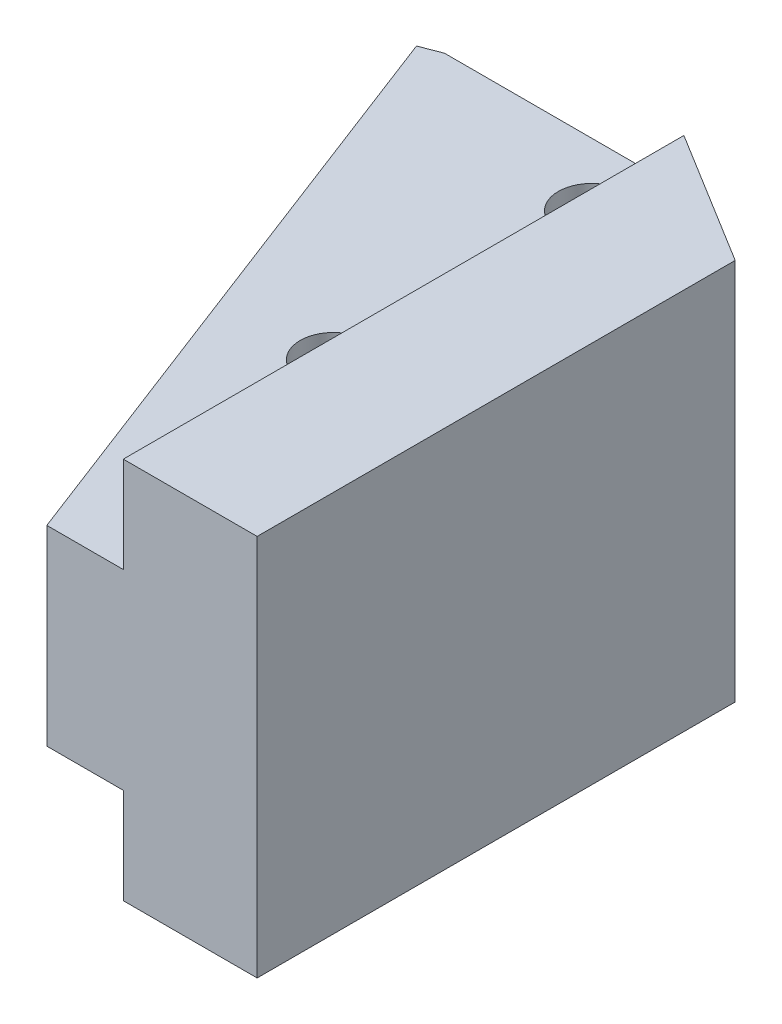
ISO-10303-21;
HEADER;
FILE_DESCRIPTION(('STEP AP214'),'2;1');
FILE_NAME('part.step','',(''),(''),'','','');
FILE_SCHEMA(('AUTOMOTIVE_DESIGN { 1 0 10303 214 1 1 1 1 }'));
ENDSEC;
DATA;
#1=APPLICATION_CONTEXT('core data for automotive mechanical design processes');
#2=APPLICATION_PROTOCOL_DEFINITION('international standard','automotive_design',2000,#1);
#3=PRODUCT_CONTEXT('',#1,'mechanical');
#4=PRODUCT('Part','Part','',(#3));
#5=PRODUCT_RELATED_PRODUCT_CATEGORY('part','',(#4));
#6=PRODUCT_DEFINITION_FORMATION('','',#4);
#7=PRODUCT_DEFINITION_CONTEXT('part definition',#1,'design');
#8=PRODUCT_DEFINITION('design','',#6,#7);
#9=PRODUCT_DEFINITION_SHAPE('','',#8);
#10=(LENGTH_UNIT() NAMED_UNIT(*) SI_UNIT(.MILLI.,.METRE.));
#11=(NAMED_UNIT(*) PLANE_ANGLE_UNIT() SI_UNIT($,.RADIAN.));
#12=(NAMED_UNIT(*) SI_UNIT($,.STERADIAN.) SOLID_ANGLE_UNIT());
#13=UNCERTAINTY_MEASURE_WITH_UNIT(LENGTH_MEASURE(1.E-05),#10,'distance_accuracy_value','');
#14=(GEOMETRIC_REPRESENTATION_CONTEXT(3) GLOBAL_UNCERTAINTY_ASSIGNED_CONTEXT((#13)) GLOBAL_UNIT_ASSIGNED_CONTEXT((#10,
#11,#12)) REPRESENTATION_CONTEXT('',''));
#15=CARTESIAN_POINT('',(0.,0.,0.));
#16=DIRECTION('',(0.,0.,1.));
#17=DIRECTION('',(1.,0.,0.));
#18=AXIS2_PLACEMENT_3D('',#15,#16,#17);
#19=CARTESIAN_POINT('',(4.,5.,40.));
#20=DIRECTION('',(0.,-1.,0.));
#21=DIRECTION('',(1.,0.,0.));
#22=AXIS2_PLACEMENT_3D('',#19,#20,#21);
#23=PLANE('',#22);
#24=CARTESIAN_POINT('',(0.,5.,25.));
#25=DIRECTION('',(0.,-1.,0.));
#26=DIRECTION('',(1.,0.,0.));
#27=AXIS2_PLACEMENT_3D('',#24,#25,#26);
#28=CIRCLE('',#27,1.75);
#29=CARTESIAN_POINT('',(1.75,5.,25.));
#30=VERTEX_POINT('',#29);
#31=EDGE_CURVE('E124',#30,#30,#28,.T.);
#32=ORIENTED_EDGE('',*,*,#31,.T.);
#33=EDGE_LOOP('',(#32));
#34=FACE_BOUND('',#33,.T.);
#35=CARTESIAN_POINT('',(-6.83481049534862E-13,5.,11.5));
#36=DIRECTION('',(0.,-1.,0.));
#37=DIRECTION('',(1.,0.,0.));
#38=AXIS2_PLACEMENT_3D('',#35,#36,#37);
#39=CIRCLE('',#38,1.75);
#40=CARTESIAN_POINT('',(1.74999999999932,5.,11.5));
#41=VERTEX_POINT('',#40);
#42=EDGE_CURVE('E154',#41,#41,#39,.T.);
#43=ORIENTED_EDGE('',*,*,#42,.T.);
#44=EDGE_LOOP('',(#43));
#45=FACE_BOUND('',#44,.T.);
#46=DIRECTION('',(0.,0.,-1.));
#47=VECTOR('',#46,1.);
#48=CARTESIAN_POINT('',(4.,5.,40.));
#49=LINE('',#48,#47);
#50=CARTESIAN_POINT('',(4.,5.,40.));
#51=VERTEX_POINT('',#50);
#52=CARTESIAN_POINT('',(4.,5.,10.6834420459416));
#53=VERTEX_POINT('',#52);
#54=EDGE_CURVE('E143',#51,#53,#49,.T.);
#55=ORIENTED_EDGE('',*,*,#54,.T.);
#56=DIRECTION('',(-0.851176775563715,0.,-0.524879125838471));
#57=VECTOR('',#56,1.);
#58=CARTESIAN_POINT('',(17.097609724484,5.,18.7600979652807));
#59=LINE('',#58,#57);
#60=CARTESIAN_POINT('',(7.32053306862213E-13,4.99999999999998,8.2168375007659));
#61=VERTEX_POINT('',#60);
#62=EDGE_CURVE('E171',#53,#61,#59,.T.);
#63=ORIENTED_EDGE('',*,*,#62,.T.);
#64=DIRECTION('',(-1.,0.,0.));
#65=VECTOR('',#64,1.);
#66=CARTESIAN_POINT('',(4.,5.,8.2168375007659));
#67=LINE('',#66,#65);
#68=CARTESIAN_POINT('',(-10.9852372608359,4.99999999999998,8.2168375007659));
#69=VERTEX_POINT('',#68);
#70=EDGE_CURVE('E168',#61,#69,#67,.T.);
#71=ORIENTED_EDGE('',*,*,#70,.T.);
#72=DIRECTION('',(-0.933580426497201,0.,0.358367949545302));
#73=VECTOR('',#72,1.);
#74=CARTESIAN_POINT('',(-12.0443509144595,5.,8.62339314140695));
#75=LINE('',#74,#73);
#76=CARTESIAN_POINT('',(-12.0443509144595,5.,8.62339314140695));
#77=VERTEX_POINT('',#76);
#78=EDGE_CURVE('E180',#69,#77,#75,.T.);
#79=ORIENTED_EDGE('',*,*,#78,.T.);
#80=DIRECTION('',(0.358367949545302,0.,0.933580426497201));
#81=VECTOR('',#80,1.);
#82=CARTESIAN_POINT('',(0.,5.,40.));
#83=LINE('',#82,#81);
#84=CARTESIAN_POINT('',(0.,5.,40.));
#85=VERTEX_POINT('',#84);
#86=EDGE_CURVE('E186',#77,#85,#83,.T.);
#87=ORIENTED_EDGE('',*,*,#86,.T.);
#88=DIRECTION('',(-1.,0.,0.));
#89=VECTOR('',#88,1.);
#90=CARTESIAN_POINT('',(4.,5.,40.));
#91=LINE('',#90,#89);
#92=EDGE_CURVE('E193',#51,#85,#91,.T.);
#93=ORIENTED_EDGE('',*,*,#92,.F.);
#94=EDGE_LOOP('',(#55,#63,#71,#79,#87,#93));
#95=FACE_BOUND('',#94,.T.);
#96=ADVANCED_FACE('F34',(#34,#45,#95),#23,.F.);
#97=CARTESIAN_POINT('',(0.,-5.,40.));
#98=DIRECTION('',(0.,1.,0.));
#99=DIRECTION('',(-1.,0.,0.));
#100=AXIS2_PLACEMENT_3D('',#97,#98,#99);
#101=PLANE('',#100);
#102=CARTESIAN_POINT('',(0.,-5.,25.));
#103=DIRECTION('',(0.,1.,0.));
#104=DIRECTION('',(-1.,0.,0.));
#105=AXIS2_PLACEMENT_3D('',#102,#103,#104);
#106=CIRCLE('',#105,1.75);
#107=CARTESIAN_POINT('',(-1.75,-5.,25.));
#108=VERTEX_POINT('',#107);
#109=EDGE_CURVE('E37',#108,#108,#106,.T.);
#110=ORIENTED_EDGE('',*,*,#109,.T.);
#111=EDGE_LOOP('',(#110));
#112=FACE_BOUND('',#111,.T.);
#113=CARTESIAN_POINT('',(-6.83481049534862E-13,-5.,11.5));
#114=DIRECTION('',(0.,1.,0.));
#115=DIRECTION('',(-1.,0.,0.));
#116=AXIS2_PLACEMENT_3D('',#113,#114,#115);
#117=CIRCLE('',#116,1.75);
#118=CARTESIAN_POINT('',(-1.75000000000069,-5.,11.5));
#119=VERTEX_POINT('',#118);
#120=EDGE_CURVE('E152',#119,#119,#117,.T.);
#121=ORIENTED_EDGE('',*,*,#120,.T.);
#122=EDGE_LOOP('',(#121));
#123=FACE_BOUND('',#122,.T.);
#124=DIRECTION('',(1.,0.,0.));
#125=VECTOR('',#124,1.);
#126=CARTESIAN_POINT('',(0.,-5.,8.2168375007659));
#127=LINE('',#126,#125);
#128=CARTESIAN_POINT('',(-10.9852372608359,-5.,8.2168375007659));
#129=VERTEX_POINT('',#128);
#130=CARTESIAN_POINT('',(7.32053306862213E-13,-5.00000000000001,8.2168375007659));
#131=VERTEX_POINT('',#130);
#132=EDGE_CURVE('E50',#129,#131,#127,.T.);
#133=ORIENTED_EDGE('',*,*,#132,.T.);
#134=DIRECTION('',(0.851176775563715,0.,0.524879125838471));
#135=VECTOR('',#134,1.);
#136=CARTESIAN_POINT('',(14.1996021114478,-5.,16.9730382777131));
#137=LINE('',#136,#135);
#138=CARTESIAN_POINT('',(4.,-5.,10.6834420459416));
#139=VERTEX_POINT('',#138);
#140=EDGE_CURVE('E177',#131,#139,#137,.T.);
#141=ORIENTED_EDGE('',*,*,#140,.T.);
#142=DIRECTION('',(0.,0.,-1.));
#143=VECTOR('',#142,1.);
#144=CARTESIAN_POINT('',(4.,-5.,40.));
#145=LINE('',#144,#143);
#146=CARTESIAN_POINT('',(4.,-5.,40.));
#147=VERTEX_POINT('',#146);
#148=EDGE_CURVE('E149',#147,#139,#145,.T.);
#149=ORIENTED_EDGE('',*,*,#148,.F.);
#150=DIRECTION('',(1.,0.,0.));
#151=VECTOR('',#150,1.);
#152=CARTESIAN_POINT('',(0.,-5.,40.));
#153=LINE('',#152,#151);
#154=CARTESIAN_POINT('',(0.,-5.,40.));
#155=VERTEX_POINT('',#154);
#156=EDGE_CURVE('E198',#155,#147,#153,.T.);
#157=ORIENTED_EDGE('',*,*,#156,.F.);
#158=DIRECTION('',(-0.358367949545302,0.,-0.933580426497201));
#159=VECTOR('',#158,1.);
#160=CARTESIAN_POINT('',(0.,-5.,40.));
#161=LINE('',#160,#159);
#162=CARTESIAN_POINT('',(-12.0443509144595,-5.,8.62339314140695));
#163=VERTEX_POINT('',#162);
#164=EDGE_CURVE('E181',#155,#163,#161,.T.);
#165=ORIENTED_EDGE('',*,*,#164,.T.);
#166=DIRECTION('',(0.933580426497201,0.,-0.358367949545302));
#167=VECTOR('',#166,1.);
#168=CARTESIAN_POINT('',(-12.0443509144595,-5.,8.62339314140695));
#169=LINE('',#168,#167);
#170=EDGE_CURVE('E183',#163,#129,#169,.T.);
#171=ORIENTED_EDGE('',*,*,#170,.T.);
#172=EDGE_LOOP('',(#133,#141,#149,#157,#165,#171));
#173=FACE_BOUND('',#172,.T.);
#174=ADVANCED_FACE('F223',(#112,#123,#173),#101,.F.);
#175=CARTESIAN_POINT('',(4.,-5.,40.));
#176=DIRECTION('',(1.,0.,0.));
#177=DIRECTION('',(0.,1.,0.));
#178=AXIS2_PLACEMENT_3D('',#175,#176,#177);
#179=PLANE('',#178);
#180=ORIENTED_EDGE('',*,*,#148,.T.);
#181=DIRECTION('',(0.,-1.,0.));
#182=VECTOR('',#181,1.);
#183=CARTESIAN_POINT('',(4.,-5.00000000000001,10.6834420459416));
#184=LINE('',#183,#182);
#185=CARTESIAN_POINT('',(4.,-10.,10.6834420459416));
#186=VERTEX_POINT('',#185);
#187=EDGE_CURVE('E174',#139,#186,#184,.T.);
#188=ORIENTED_EDGE('',*,*,#187,.T.);
#189=DIRECTION('',(0.,0.,-1.));
#190=VECTOR('',#189,1.);
#191=CARTESIAN_POINT('',(4.,-10.,40.));
#192=LINE('',#191,#190);
#193=CARTESIAN_POINT('',(4.,-10.,40.));
#194=VERTEX_POINT('',#193);
#195=EDGE_CURVE('E141',#194,#186,#192,.T.);
#196=ORIENTED_EDGE('',*,*,#195,.F.);
#197=DIRECTION('',(0.,-1.,0.));
#198=VECTOR('',#197,1.);
#199=CARTESIAN_POINT('',(4.,-5.,40.));
#200=LINE('',#199,#198);
#201=EDGE_CURVE('E200',#147,#194,#200,.T.);
#202=ORIENTED_EDGE('',*,*,#201,.F.);
#203=EDGE_LOOP('',(#180,#188,#196,#202));
#204=FACE_BOUND('',#203,.T.);
#205=ADVANCED_FACE('F228',(#204),#179,.F.);
#206=CARTESIAN_POINT('',(4.,-10.,40.));
#207=DIRECTION('',(0.,1.,0.));
#208=DIRECTION('',(0.,0.,1.));
#209=AXIS2_PLACEMENT_3D('',#206,#207,#208);
#210=PLANE('',#209);
#211=ORIENTED_EDGE('',*,*,#195,.T.);
#212=DIRECTION('',(-0.851176775563715,0.,-0.524879125838471));
#213=VECTOR('',#212,1.);
#214=CARTESIAN_POINT('',(7.32053306862213E-13,-10.,8.2168375007659));
#215=LINE('',#214,#213);
#216=CARTESIAN_POINT('',(11.,-10.,15.));
#217=VERTEX_POINT('',#216);
#218=EDGE_CURVE('E135',#217,#186,#215,.T.);
#219=ORIENTED_EDGE('',*,*,#218,.F.);
#220=DIRECTION('',(0.,0.,-1.));
#221=VECTOR('',#220,1.);
#222=CARTESIAN_POINT('',(11.,-10.,40.));
#223=LINE('',#222,#221);
#224=CARTESIAN_POINT('',(11.,-10.,40.));
#225=VERTEX_POINT('',#224);
#226=EDGE_CURVE('E134',#225,#217,#223,.T.);
#227=ORIENTED_EDGE('',*,*,#226,.F.);
#228=DIRECTION('',(1.,0.,0.));
#229=VECTOR('',#228,1.);
#230=CARTESIAN_POINT('',(4.,-10.,40.));
#231=LINE('',#230,#229);
#232=EDGE_CURVE('E202',#194,#225,#231,.T.);
#233=ORIENTED_EDGE('',*,*,#232,.F.);
#234=EDGE_LOOP('',(#211,#219,#227,#233));
#235=FACE_BOUND('',#234,.T.);
#236=ADVANCED_FACE('F269',(#235),#210,.F.);
#237=CARTESIAN_POINT('',(11.,-10.,40.));
#238=DIRECTION('',(-1.,0.,0.));
#239=DIRECTION('',(0.,0.,1.));
#240=AXIS2_PLACEMENT_3D('',#237,#238,#239);
#241=PLANE('',#240);
#242=ORIENTED_EDGE('',*,*,#226,.T.);
#243=DIRECTION('',(0.,1.,0.));
#244=VECTOR('',#243,1.);
#245=CARTESIAN_POINT('',(11.,-36.6148578319563,15.));
#246=LINE('',#245,#244);
#247=CARTESIAN_POINT('',(11.,10.,15.));
#248=VERTEX_POINT('',#247);
#249=EDGE_CURVE('E117',#217,#248,#246,.T.);
#250=ORIENTED_EDGE('',*,*,#249,.T.);
#251=DIRECTION('',(0.,0.,-1.));
#252=VECTOR('',#251,1.);
#253=CARTESIAN_POINT('',(11.,10.,40.));
#254=LINE('',#253,#252);
#255=CARTESIAN_POINT('',(11.,10.,40.));
#256=VERTEX_POINT('',#255);
#257=EDGE_CURVE('E131',#256,#248,#254,.T.);
#258=ORIENTED_EDGE('',*,*,#257,.F.);
#259=DIRECTION('',(0.,1.,0.));
#260=VECTOR('',#259,1.);
#261=CARTESIAN_POINT('',(11.,-10.,40.));
#262=LINE('',#261,#260);
#263=EDGE_CURVE('E204',#225,#256,#262,.T.);
#264=ORIENTED_EDGE('',*,*,#263,.F.);
#265=EDGE_LOOP('',(#242,#250,#258,#264));
#266=FACE_BOUND('',#265,.T.);
#267=ADVANCED_FACE('F129',(#266),#241,.F.);
#268=CARTESIAN_POINT('',(11.,10.,40.));
#269=DIRECTION('',(0.,-1.,0.));
#270=DIRECTION('',(0.,0.,-1.));
#271=AXIS2_PLACEMENT_3D('',#268,#269,#270);
#272=PLANE('',#271);
#273=ORIENTED_EDGE('',*,*,#257,.T.);
#274=DIRECTION('',(0.851176775563715,0.,0.524879125838471));
#275=VECTOR('',#274,1.);
#276=CARTESIAN_POINT('',(7.32053306862213E-13,10.,8.2168375007659));
#277=LINE('',#276,#275);
#278=CARTESIAN_POINT('',(4.,10.,10.6834420459417));
#279=VERTEX_POINT('',#278);
#280=EDGE_CURVE('E113',#279,#248,#277,.T.);
#281=ORIENTED_EDGE('',*,*,#280,.F.);
#282=DIRECTION('',(0.,0.,-1.));
#283=VECTOR('',#282,1.);
#284=CARTESIAN_POINT('',(4.,10.,40.));
#285=LINE('',#284,#283);
#286=CARTESIAN_POINT('',(4.,10.,40.));
#287=VERTEX_POINT('',#286);
#288=EDGE_CURVE('E139',#287,#279,#285,.T.);
#289=ORIENTED_EDGE('',*,*,#288,.F.);
#290=DIRECTION('',(-1.,0.,0.));
#291=VECTOR('',#290,1.);
#292=CARTESIAN_POINT('',(11.,10.,40.));
#293=LINE('',#292,#291);
#294=EDGE_CURVE('E138',#256,#287,#293,.T.);
#295=ORIENTED_EDGE('',*,*,#294,.F.);
#296=EDGE_LOOP('',(#273,#281,#289,#295));
#297=FACE_BOUND('',#296,.T.);
#298=ADVANCED_FACE('F137',(#297),#272,.F.);
#299=CARTESIAN_POINT('',(4.,10.,40.));
#300=DIRECTION('',(1.,0.,0.));
#301=DIRECTION('',(0.,1.,0.));
#302=AXIS2_PLACEMENT_3D('',#299,#300,#301);
#303=PLANE('',#302);
#304=ORIENTED_EDGE('',*,*,#288,.T.);
#305=DIRECTION('',(0.,-1.,0.));
#306=VECTOR('',#305,1.);
#307=CARTESIAN_POINT('',(4.,10.,10.6834420459416));
#308=LINE('',#307,#306);
#309=EDGE_CURVE('E11',#279,#53,#308,.T.);
#310=ORIENTED_EDGE('',*,*,#309,.T.);
#311=ORIENTED_EDGE('',*,*,#54,.F.);
#312=DIRECTION('',(0.,-1.,0.));
#313=VECTOR('',#312,1.);
#314=CARTESIAN_POINT('',(4.,10.,40.));
#315=LINE('',#314,#313);
#316=EDGE_CURVE('E58',#287,#51,#315,.T.);
#317=ORIENTED_EDGE('',*,*,#316,.F.);
#318=EDGE_LOOP('',(#304,#310,#311,#317));
#319=FACE_BOUND('',#318,.T.);
#320=ADVANCED_FACE('F211',(#319),#303,.F.);
#321=CARTESIAN_POINT('',(0.,0.,40.));
#322=DIRECTION('',(0.,0.,1.));
#323=DIRECTION('',(1.,0.,0.));
#324=AXIS2_PLACEMENT_3D('',#321,#322,#323);
#325=PLANE('',#324);
#326=ORIENTED_EDGE('',*,*,#92,.T.);
#327=DIRECTION('',(0.,-1.,0.));
#328=VECTOR('',#327,1.);
#329=CARTESIAN_POINT('',(0.,5.,40.));
#330=LINE('',#329,#328);
#331=EDGE_CURVE('E195',#85,#155,#330,.T.);
#332=ORIENTED_EDGE('',*,*,#331,.T.);
#333=ORIENTED_EDGE('',*,*,#156,.T.);
#334=ORIENTED_EDGE('',*,*,#201,.T.);
#335=ORIENTED_EDGE('',*,*,#232,.T.);
#336=ORIENTED_EDGE('',*,*,#263,.T.);
#337=ORIENTED_EDGE('',*,*,#294,.T.);
#338=ORIENTED_EDGE('',*,*,#316,.T.);
#339=EDGE_LOOP('',(#326,#332,#333,#334,#335,#336,#337,#338));
#340=FACE_BOUND('',#339,.T.);
#341=ADVANCED_FACE('F213',(#340),#325,.T.);
#342=CARTESIAN_POINT('',(0.,-42.9613802297893,40.));
#343=DIRECTION('',(-0.933580426497201,0.,0.358367949545302));
#344=DIRECTION('',(0.358367949545302,0.,0.933580426497201));
#345=AXIS2_PLACEMENT_3D('',#342,#343,#344);
#346=PLANE('',#345);
#347=ORIENTED_EDGE('',*,*,#164,.F.);
#348=ORIENTED_EDGE('',*,*,#331,.F.);
#349=ORIENTED_EDGE('',*,*,#86,.F.);
#350=DIRECTION('',(0.,1.,0.));
#351=VECTOR('',#350,1.);
#352=CARTESIAN_POINT('',(-12.0443509144595,-42.9613802297893,8.62339314140695));
#353=LINE('',#352,#351);
#354=EDGE_CURVE('E184',#163,#77,#353,.T.);
#355=ORIENTED_EDGE('',*,*,#354,.F.);
#356=EDGE_LOOP('',(#347,#348,#349,#355));
#357=FACE_BOUND('',#356,.T.);
#358=ADVANCED_FACE('F219',(#357),#346,.T.);
#359=CARTESIAN_POINT('',(-12.0443509144595,-42.9613802297893,8.62339314140695));
#360=DIRECTION('',(-0.358367949545302,0.,-0.933580426497201));
#361=DIRECTION('',(-0.933580426497201,0.,0.358367949545302));
#362=AXIS2_PLACEMENT_3D('',#359,#360,#361);
#363=PLANE('',#362);
#364=DIRECTION('',(0.,1.,0.));
#365=VECTOR('',#364,1.);
#366=CARTESIAN_POINT('',(-10.9852372608359,-42.9613802297893,8.2168375007659));
#367=LINE('',#366,#365);
#368=EDGE_CURVE('E42',#129,#69,#367,.T.);
#369=ORIENTED_EDGE('',*,*,#368,.F.);
#370=ORIENTED_EDGE('',*,*,#170,.F.);
#371=ORIENTED_EDGE('',*,*,#354,.T.);
#372=ORIENTED_EDGE('',*,*,#78,.F.);
#373=EDGE_LOOP('',(#369,#370,#371,#372));
#374=FACE_BOUND('',#373,.T.);
#375=ADVANCED_FACE('F247',(#374),#363,.T.);
#376=CARTESIAN_POINT('',(7.32053306862213E-13,-36.6148578319563,8.2168375007659));
#377=DIRECTION('',(-0.524879125838471,0.,0.851176775563715));
#378=DIRECTION('',(0.851176775563715,0.,0.524879125838471));
#379=AXIS2_PLACEMENT_3D('',#376,#377,#378);
#380=PLANE('',#379);
#381=DIRECTION('',(0.,1.,0.));
#382=VECTOR('',#381,1.);
#383=CARTESIAN_POINT('',(7.32053306862213E-13,-36.6148578319563,8.2168375007659));
#384=LINE('',#383,#382);
#385=EDGE_CURVE('E123',#131,#61,#384,.T.);
#386=ORIENTED_EDGE('',*,*,#385,.T.);
#387=ORIENTED_EDGE('',*,*,#62,.F.);
#388=ORIENTED_EDGE('',*,*,#309,.F.);
#389=ORIENTED_EDGE('',*,*,#280,.T.);
#390=ORIENTED_EDGE('',*,*,#249,.F.);
#391=ORIENTED_EDGE('',*,*,#218,.T.);
#392=ORIENTED_EDGE('',*,*,#187,.F.);
#393=ORIENTED_EDGE('',*,*,#140,.F.);
#394=EDGE_LOOP('',(#386,#387,#388,#389,#390,#391,#392,#393));
#395=FACE_BOUND('',#394,.T.);
#396=ADVANCED_FACE('F116',(#395),#380,.F.);
#397=CARTESIAN_POINT('',(-10.9852372608359,-36.6148578319563,8.2168375007659));
#398=DIRECTION('',(0.,0.,1.));
#399=DIRECTION('',(1.,0.,0.));
#400=AXIS2_PLACEMENT_3D('',#397,#398,#399);
#401=PLANE('',#400);
#402=ORIENTED_EDGE('',*,*,#385,.F.);
#403=ORIENTED_EDGE('',*,*,#132,.F.);
#404=ORIENTED_EDGE('',*,*,#368,.T.);
#405=ORIENTED_EDGE('',*,*,#70,.F.);
#406=EDGE_LOOP('',(#402,#403,#404,#405));
#407=FACE_BOUND('',#406,.T.);
#408=ADVANCED_FACE('F240',(#407),#401,.F.);
#409=CARTESIAN_POINT('',(-6.83481049534862E-13,-10.,11.5));
#410=DIRECTION('',(0.,1.,0.));
#411=DIRECTION('',(0.,0.,1.));
#412=AXIS2_PLACEMENT_3D('',#409,#410,#411);
#413=CYLINDRICAL_SURFACE('',#412,1.75);
#414=ORIENTED_EDGE('',*,*,#120,.F.);
#415=EDGE_LOOP('',(#414));
#416=FACE_BOUND('',#415,.T.);
#417=ORIENTED_EDGE('',*,*,#42,.F.);
#418=EDGE_LOOP('',(#417));
#419=FACE_BOUND('',#418,.T.);
#420=ADVANCED_FACE('F234',(#416,#419),#413,.F.);
#421=CARTESIAN_POINT('',(0.,-10.,25.));
#422=DIRECTION('',(0.,1.,0.));
#423=DIRECTION('',(0.,0.,1.));
#424=AXIS2_PLACEMENT_3D('',#421,#422,#423);
#425=CYLINDRICAL_SURFACE('',#424,1.75);
#426=ORIENTED_EDGE('',*,*,#109,.F.);
#427=EDGE_LOOP('',(#426));
#428=FACE_BOUND('',#427,.T.);
#429=ORIENTED_EDGE('',*,*,#31,.F.);
#430=EDGE_LOOP('',(#429));
#431=FACE_BOUND('',#430,.T.);
#432=ADVANCED_FACE('F232',(#428,#431),#425,.F.);
#433=CLOSED_SHELL('',(#96,#174,#205,#236,#267,#298,#320,#341,#358,#375,#396,#408,#420,#432));
#434=MANIFOLD_SOLID_BREP('B2',#433);
#435=ADVANCED_BREP_SHAPE_REPRESENTATION('',(#18,#434),#14);
#436=SHAPE_DEFINITION_REPRESENTATION(#9,#435);
ENDSEC;
END-ISO-10303-21;
